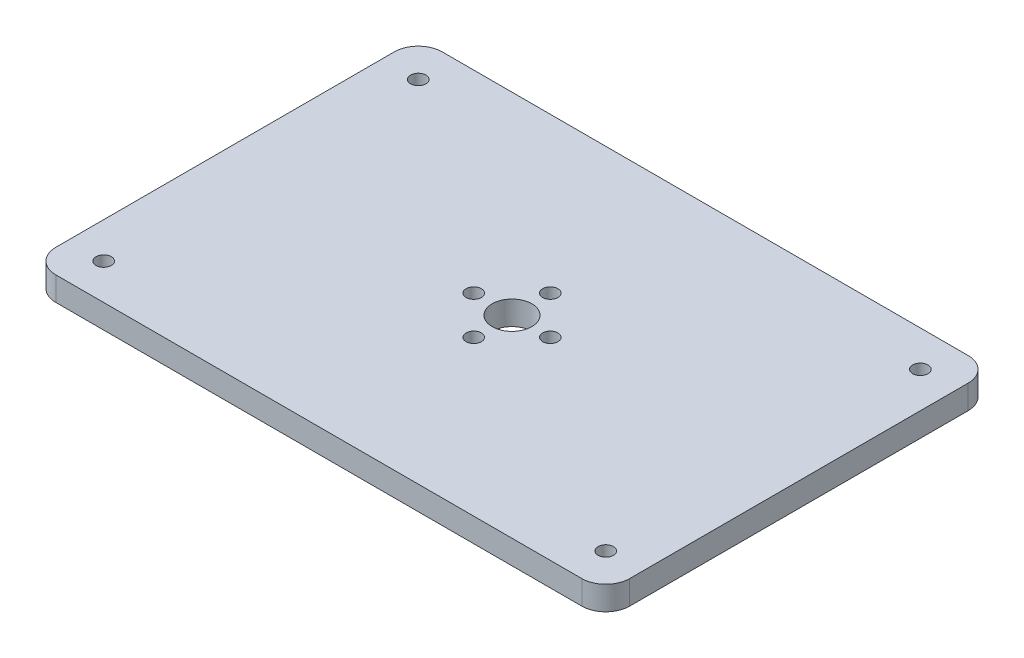
ISO-10303-21;
HEADER;
FILE_DESCRIPTION(('STEP AP214'),'2;1');
FILE_NAME('part.step','',(''),(''),'','','');
FILE_SCHEMA(('AUTOMOTIVE_DESIGN { 1 0 10303 214 1 1 1 1 }'));
ENDSEC;
DATA;
#1=APPLICATION_CONTEXT('core data for automotive mechanical design processes');
#2=APPLICATION_PROTOCOL_DEFINITION('international standard','automotive_design',2000,#1);
#3=PRODUCT_CONTEXT('',#1,'mechanical');
#4=PRODUCT('Part','Part','',(#3));
#5=PRODUCT_RELATED_PRODUCT_CATEGORY('part','',(#4));
#6=PRODUCT_DEFINITION_FORMATION('','',#4);
#7=PRODUCT_DEFINITION_CONTEXT('part definition',#1,'design');
#8=PRODUCT_DEFINITION('design','',#6,#7);
#9=PRODUCT_DEFINITION_SHAPE('','',#8);
#10=(LENGTH_UNIT() NAMED_UNIT(*) SI_UNIT(.MILLI.,.METRE.));
#11=(NAMED_UNIT(*) PLANE_ANGLE_UNIT() SI_UNIT($,.RADIAN.));
#12=(NAMED_UNIT(*) SI_UNIT($,.STERADIAN.) SOLID_ANGLE_UNIT());
#13=UNCERTAINTY_MEASURE_WITH_UNIT(LENGTH_MEASURE(1.E-05),#10,'distance_accuracy_value','');
#14=(GEOMETRIC_REPRESENTATION_CONTEXT(3) GLOBAL_UNCERTAINTY_ASSIGNED_CONTEXT((#13)) GLOBAL_UNIT_ASSIGNED_CONTEXT((#10,
#11,#12)) REPRESENTATION_CONTEXT('',''));
#15=CARTESIAN_POINT('',(0.,0.,0.));
#16=DIRECTION('',(0.,0.,1.));
#17=DIRECTION('',(1.,0.,0.));
#18=AXIS2_PLACEMENT_3D('',#15,#16,#17);
#19=CARTESIAN_POINT('',(0.,5.,0.));
#20=DIRECTION('',(0.,-1.,0.));
#21=DIRECTION('',(0.,0.,-1.));
#22=AXIS2_PLACEMENT_3D('',#19,#20,#21);
#23=PLANE('',#22);
#24=CARTESIAN_POINT('',(7.50000000000001,5.,-73.29));
#25=DIRECTION('',(0.,1.,0.));
#26=DIRECTION('',(0.,0.,1.));
#27=AXIS2_PLACEMENT_3D('',#24,#25,#26);
#28=CIRCLE('',#27,1.6);
#29=CARTESIAN_POINT('',(7.50000000000001,5.,-71.69));
#30=VERTEX_POINT('',#29);
#31=EDGE_CURVE('E215',#30,#30,#28,.T.);
#32=ORIENTED_EDGE('',*,*,#31,.F.);
#33=EDGE_LOOP('',(#32));
#34=FACE_BOUND('',#33,.T.);
#35=CARTESIAN_POINT('',(112.5,5.,-7.49999999999998));
#36=DIRECTION('',(0.,1.,0.));
#37=DIRECTION('',(0.,0.,-1.));
#38=AXIS2_PLACEMENT_3D('',#35,#36,#37);
#39=CIRCLE('',#38,1.60000000000001);
#40=CARTESIAN_POINT('',(112.5,5.,-9.09999999999998));
#41=VERTEX_POINT('',#40);
#42=EDGE_CURVE('E221',#41,#41,#39,.T.);
#43=ORIENTED_EDGE('',*,*,#42,.F.);
#44=EDGE_LOOP('',(#43));
#45=FACE_BOUND('',#44,.T.);
#46=CARTESIAN_POINT('',(112.5,5.,-73.29));
#47=DIRECTION('',(0.,1.,0.));
#48=DIRECTION('',(0.,0.,-1.));
#49=AXIS2_PLACEMENT_3D('',#46,#47,#48);
#50=CIRCLE('',#49,1.60000000000001);
#51=CARTESIAN_POINT('',(112.5,5.,-74.8900000000001));
#52=VERTEX_POINT('',#51);
#53=EDGE_CURVE('E222',#52,#52,#50,.T.);
#54=ORIENTED_EDGE('',*,*,#53,.F.);
#55=EDGE_LOOP('',(#54));
#56=FACE_BOUND('',#55,.T.);
#57=CARTESIAN_POINT('',(7.50000000000001,5.,-7.50000000000001));
#58=DIRECTION('',(0.,1.,0.));
#59=DIRECTION('',(0.,0.,1.));
#60=AXIS2_PLACEMENT_3D('',#57,#58,#59);
#61=CIRCLE('',#60,1.6);
#62=CARTESIAN_POINT('',(7.50000000000001,5.,-5.90000000000001));
#63=VERTEX_POINT('',#62);
#64=EDGE_CURVE('E212',#63,#63,#61,.T.);
#65=ORIENTED_EDGE('',*,*,#64,.F.);
#66=EDGE_LOOP('',(#65));
#67=FACE_BOUND('',#66,.T.);
#68=DIRECTION('',(0.,0.,-1.));
#69=VECTOR('',#68,1.);
#70=CARTESIAN_POINT('',(120.,5.,0.));
#71=LINE('',#70,#69);
#72=CARTESIAN_POINT('',(120.,5.,-5.));
#73=VERTEX_POINT('',#72);
#74=CARTESIAN_POINT('',(120.,5.,-75.79));
#75=VERTEX_POINT('',#74);
#76=EDGE_CURVE('E181',#73,#75,#71,.T.);
#77=ORIENTED_EDGE('',*,*,#76,.T.);
#78=CARTESIAN_POINT('',(115.,5.,-75.79));
#79=DIRECTION('',(0.,-1.,0.));
#80=DIRECTION('',(0.,0.,-1.));
#81=AXIS2_PLACEMENT_3D('',#78,#79,#80);
#82=CIRCLE('',#81,5.);
#83=CARTESIAN_POINT('',(115.,5.,-80.79));
#84=VERTEX_POINT('',#83);
#85=EDGE_CURVE('E158',#75,#84,#82,.F.);
#86=ORIENTED_EDGE('',*,*,#85,.T.);
#87=DIRECTION('',(-1.,0.,0.));
#88=VECTOR('',#87,1.);
#89=CARTESIAN_POINT('',(0.,5.,-80.79));
#90=LINE('',#89,#88);
#91=CARTESIAN_POINT('',(5.,5.,-80.79));
#92=VERTEX_POINT('',#91);
#93=EDGE_CURVE('E129',#84,#92,#90,.T.);
#94=ORIENTED_EDGE('',*,*,#93,.T.);
#95=CARTESIAN_POINT('',(5.,5.,-75.79));
#96=DIRECTION('',(0.,-1.,0.));
#97=DIRECTION('',(0.,0.,-1.));
#98=AXIS2_PLACEMENT_3D('',#95,#96,#97);
#99=CIRCLE('',#98,5.);
#100=CARTESIAN_POINT('',(0.,5.,-75.79));
#101=VERTEX_POINT('',#100);
#102=EDGE_CURVE('E153',#92,#101,#99,.F.);
#103=ORIENTED_EDGE('',*,*,#102,.T.);
#104=DIRECTION('',(0.,0.,1.));
#105=VECTOR('',#104,1.);
#106=CARTESIAN_POINT('',(0.,5.,0.));
#107=LINE('',#106,#105);
#108=CARTESIAN_POINT('',(0.,5.,-5.));
#109=VERTEX_POINT('',#108);
#110=EDGE_CURVE('E136',#101,#109,#107,.T.);
#111=ORIENTED_EDGE('',*,*,#110,.T.);
#112=CARTESIAN_POINT('',(5.,5.,-5.));
#113=DIRECTION('',(0.,-1.,0.));
#114=DIRECTION('',(0.,0.,-1.));
#115=AXIS2_PLACEMENT_3D('',#112,#113,#114);
#116=CIRCLE('',#115,5.);
#117=CARTESIAN_POINT('',(5.,5.,0.));
#118=VERTEX_POINT('',#117);
#119=EDGE_CURVE('E65',#109,#118,#116,.F.);
#120=ORIENTED_EDGE('',*,*,#119,.T.);
#121=DIRECTION('',(1.,0.,0.));
#122=VECTOR('',#121,1.);
#123=CARTESIAN_POINT('',(0.,5.,0.));
#124=LINE('',#123,#122);
#125=CARTESIAN_POINT('',(115.,5.,0.));
#126=VERTEX_POINT('',#125);
#127=EDGE_CURVE('E139',#118,#126,#124,.T.);
#128=ORIENTED_EDGE('',*,*,#127,.T.);
#129=CARTESIAN_POINT('',(115.,5.,-5.));
#130=DIRECTION('',(0.,-1.,0.));
#131=DIRECTION('',(0.,0.,-1.));
#132=AXIS2_PLACEMENT_3D('',#129,#130,#131);
#133=CIRCLE('',#132,5.);
#134=EDGE_CURVE('E156',#126,#73,#133,.F.);
#135=ORIENTED_EDGE('',*,*,#134,.T.);
#136=EDGE_LOOP('',(#77,#86,#94,#103,#111,#120,#128,#135));
#137=FACE_BOUND('',#136,.T.);
#138=CARTESIAN_POINT('',(52.,5.,-40.395));
#139=DIRECTION('',(0.,1.,0.));
#140=DIRECTION('',(0.,0.,1.));
#141=AXIS2_PLACEMENT_3D('',#138,#139,#140);
#142=CIRCLE('',#141,1.6);
#143=CARTESIAN_POINT('',(52.,5.,-38.795));
#144=VERTEX_POINT('',#143);
#145=EDGE_CURVE('E174',#144,#144,#142,.T.);
#146=ORIENTED_EDGE('',*,*,#145,.F.);
#147=EDGE_LOOP('',(#146));
#148=FACE_BOUND('',#147,.T.);
#149=CARTESIAN_POINT('',(60.,5.,-40.395));
#150=DIRECTION('',(0.,1.,0.));
#151=DIRECTION('',(0.,0.,1.));
#152=AXIS2_PLACEMENT_3D('',#149,#150,#151);
#153=CIRCLE('',#152,4.15);
#154=CARTESIAN_POINT('',(60.,5.,-36.245));
#155=VERTEX_POINT('',#154);
#156=EDGE_CURVE('E186',#155,#155,#153,.T.);
#157=ORIENTED_EDGE('',*,*,#156,.F.);
#158=EDGE_LOOP('',(#157));
#159=FACE_BOUND('',#158,.T.);
#160=CARTESIAN_POINT('',(60.,5.,-48.395));
#161=DIRECTION('',(0.,1.,0.));
#162=DIRECTION('',(0.,0.,1.));
#163=AXIS2_PLACEMENT_3D('',#160,#161,#162);
#164=CIRCLE('',#163,1.60000000000001);
#165=CARTESIAN_POINT('',(60.,5.,-46.795));
#166=VERTEX_POINT('',#165);
#167=EDGE_CURVE('E191',#166,#166,#164,.T.);
#168=ORIENTED_EDGE('',*,*,#167,.F.);
#169=EDGE_LOOP('',(#168));
#170=FACE_BOUND('',#169,.T.);
#171=CARTESIAN_POINT('',(68.,5.,-40.395));
#172=DIRECTION('',(0.,1.,0.));
#173=DIRECTION('',(0.,0.,1.));
#174=AXIS2_PLACEMENT_3D('',#171,#172,#173);
#175=CIRCLE('',#174,1.59999999999999);
#176=CARTESIAN_POINT('',(68.,5.,-38.795));
#177=VERTEX_POINT('',#176);
#178=EDGE_CURVE('E197',#177,#177,#175,.T.);
#179=ORIENTED_EDGE('',*,*,#178,.F.);
#180=EDGE_LOOP('',(#179));
#181=FACE_BOUND('',#180,.T.);
#182=CARTESIAN_POINT('',(60.,5.,-32.395));
#183=DIRECTION('',(0.,1.,0.));
#184=DIRECTION('',(0.,0.,1.));
#185=AXIS2_PLACEMENT_3D('',#182,#183,#184);
#186=CIRCLE('',#185,1.6);
#187=CARTESIAN_POINT('',(60.,5.,-30.795));
#188=VERTEX_POINT('',#187);
#189=EDGE_CURVE('E203',#188,#188,#186,.T.);
#190=ORIENTED_EDGE('',*,*,#189,.F.);
#191=EDGE_LOOP('',(#190));
#192=FACE_BOUND('',#191,.T.);
#193=ADVANCED_FACE('F43',(#34,#45,#56,#67,#137,#148,#159,#170,#181,#192),#23,.F.);
#194=CARTESIAN_POINT('',(0.,0.,0.));
#195=DIRECTION('',(0.,-1.,0.));
#196=DIRECTION('',(0.,0.,-1.));
#197=AXIS2_PLACEMENT_3D('',#194,#195,#196);
#198=PLANE('',#197);
#199=CARTESIAN_POINT('',(7.50000000000001,0.,-73.29));
#200=DIRECTION('',(0.,1.,0.));
#201=DIRECTION('',(0.,0.,1.));
#202=AXIS2_PLACEMENT_3D('',#199,#200,#201);
#203=CIRCLE('',#202,1.6);
#204=CARTESIAN_POINT('',(7.50000000000001,0.,-71.69));
#205=VERTEX_POINT('',#204);
#206=EDGE_CURVE('E225',#205,#205,#203,.T.);
#207=ORIENTED_EDGE('',*,*,#206,.T.);
#208=EDGE_LOOP('',(#207));
#209=FACE_BOUND('',#208,.T.);
#210=CARTESIAN_POINT('',(112.5,0.,-7.49999999999998));
#211=DIRECTION('',(0.,1.,0.));
#212=DIRECTION('',(0.,0.,-1.));
#213=AXIS2_PLACEMENT_3D('',#210,#211,#212);
#214=CIRCLE('',#213,1.60000000000001);
#215=CARTESIAN_POINT('',(112.5,0.,-9.09999999999998));
#216=VERTEX_POINT('',#215);
#217=EDGE_CURVE('E218',#216,#216,#214,.T.);
#218=ORIENTED_EDGE('',*,*,#217,.T.);
#219=EDGE_LOOP('',(#218));
#220=FACE_BOUND('',#219,.T.);
#221=CARTESIAN_POINT('',(112.5,0.,-73.29));
#222=DIRECTION('',(0.,1.,0.));
#223=DIRECTION('',(0.,0.,-1.));
#224=AXIS2_PLACEMENT_3D('',#221,#222,#223);
#225=CIRCLE('',#224,1.60000000000001);
#226=CARTESIAN_POINT('',(112.5,0.,-74.8900000000001));
#227=VERTEX_POINT('',#226);
#228=EDGE_CURVE('E230',#227,#227,#225,.T.);
#229=ORIENTED_EDGE('',*,*,#228,.T.);
#230=EDGE_LOOP('',(#229));
#231=FACE_BOUND('',#230,.T.);
#232=CARTESIAN_POINT('',(7.50000000000001,0.,-7.50000000000001));
#233=DIRECTION('',(0.,1.,0.));
#234=DIRECTION('',(0.,0.,1.));
#235=AXIS2_PLACEMENT_3D('',#232,#233,#234);
#236=CIRCLE('',#235,1.6);
#237=CARTESIAN_POINT('',(7.50000000000001,0.,-5.90000000000001));
#238=VERTEX_POINT('',#237);
#239=EDGE_CURVE('E209',#238,#238,#236,.T.);
#240=ORIENTED_EDGE('',*,*,#239,.T.);
#241=EDGE_LOOP('',(#240));
#242=FACE_BOUND('',#241,.T.);
#243=CARTESIAN_POINT('',(68.,0.,-40.395));
#244=DIRECTION('',(0.,1.,0.));
#245=DIRECTION('',(0.,0.,1.));
#246=AXIS2_PLACEMENT_3D('',#243,#244,#245);
#247=CIRCLE('',#246,1.59999999999999);
#248=CARTESIAN_POINT('',(68.,0.,-38.795));
#249=VERTEX_POINT('',#248);
#250=EDGE_CURVE('E200',#249,#249,#247,.T.);
#251=ORIENTED_EDGE('',*,*,#250,.T.);
#252=EDGE_LOOP('',(#251));
#253=FACE_BOUND('',#252,.T.);
#254=CARTESIAN_POINT('',(60.,0.,-40.395));
#255=DIRECTION('',(0.,1.,0.));
#256=DIRECTION('',(0.,0.,1.));
#257=AXIS2_PLACEMENT_3D('',#254,#255,#256);
#258=CIRCLE('',#257,4.15);
#259=CARTESIAN_POINT('',(60.,0.,-36.245));
#260=VERTEX_POINT('',#259);
#261=EDGE_CURVE('E188',#260,#260,#258,.T.);
#262=ORIENTED_EDGE('',*,*,#261,.T.);
#263=EDGE_LOOP('',(#262));
#264=FACE_BOUND('',#263,.T.);
#265=DIRECTION('',(-1.,0.,0.));
#266=VECTOR('',#265,1.);
#267=CARTESIAN_POINT('',(0.,0.,-80.79));
#268=LINE('',#267,#266);
#269=CARTESIAN_POINT('',(115.,0.,-80.79));
#270=VERTEX_POINT('',#269);
#271=CARTESIAN_POINT('',(5.,0.,-80.79));
#272=VERTEX_POINT('',#271);
#273=EDGE_CURVE('E126',#270,#272,#268,.T.);
#274=ORIENTED_EDGE('',*,*,#273,.F.);
#275=CARTESIAN_POINT('',(115.,0.,-75.79));
#276=DIRECTION('',(0.,-1.,0.));
#277=DIRECTION('',(0.,0.,-1.));
#278=AXIS2_PLACEMENT_3D('',#275,#276,#277);
#279=CIRCLE('',#278,5.);
#280=CARTESIAN_POINT('',(120.,0.,-75.79));
#281=VERTEX_POINT('',#280);
#282=EDGE_CURVE('E109',#270,#281,#279,.T.);
#283=ORIENTED_EDGE('',*,*,#282,.T.);
#284=DIRECTION('',(0.,0.,-1.));
#285=VECTOR('',#284,1.);
#286=CARTESIAN_POINT('',(120.,0.,0.));
#287=LINE('',#286,#285);
#288=CARTESIAN_POINT('',(120.,0.,-5.));
#289=VERTEX_POINT('',#288);
#290=EDGE_CURVE('E137',#289,#281,#287,.T.);
#291=ORIENTED_EDGE('',*,*,#290,.F.);
#292=CARTESIAN_POINT('',(115.,0.,-5.));
#293=DIRECTION('',(0.,-1.,0.));
#294=DIRECTION('',(0.,0.,-1.));
#295=AXIS2_PLACEMENT_3D('',#292,#293,#294);
#296=CIRCLE('',#295,5.);
#297=CARTESIAN_POINT('',(115.,0.,0.));
#298=VERTEX_POINT('',#297);
#299=EDGE_CURVE('E120',#289,#298,#296,.T.);
#300=ORIENTED_EDGE('',*,*,#299,.T.);
#301=DIRECTION('',(1.,0.,0.));
#302=VECTOR('',#301,1.);
#303=CARTESIAN_POINT('',(0.,0.,0.));
#304=LINE('',#303,#302);
#305=CARTESIAN_POINT('',(5.,0.,0.));
#306=VERTEX_POINT('',#305);
#307=EDGE_CURVE('E141',#306,#298,#304,.T.);
#308=ORIENTED_EDGE('',*,*,#307,.F.);
#309=CARTESIAN_POINT('',(5.,0.,-5.));
#310=DIRECTION('',(0.,-1.,0.));
#311=DIRECTION('',(0.,0.,-1.));
#312=AXIS2_PLACEMENT_3D('',#309,#310,#311);
#313=CIRCLE('',#312,5.);
#314=CARTESIAN_POINT('',(0.,0.,-5.));
#315=VERTEX_POINT('',#314);
#316=EDGE_CURVE('E147',#306,#315,#313,.T.);
#317=ORIENTED_EDGE('',*,*,#316,.T.);
#318=DIRECTION('',(0.,0.,1.));
#319=VECTOR('',#318,1.);
#320=CARTESIAN_POINT('',(0.,0.,0.));
#321=LINE('',#320,#319);
#322=CARTESIAN_POINT('',(0.,0.,-75.79));
#323=VERTEX_POINT('',#322);
#324=EDGE_CURVE('E169',#323,#315,#321,.T.);
#325=ORIENTED_EDGE('',*,*,#324,.F.);
#326=CARTESIAN_POINT('',(5.,0.,-75.79));
#327=DIRECTION('',(0.,-1.,0.));
#328=DIRECTION('',(0.,0.,-1.));
#329=AXIS2_PLACEMENT_3D('',#326,#327,#328);
#330=CIRCLE('',#329,5.);
#331=EDGE_CURVE('E130',#323,#272,#330,.T.);
#332=ORIENTED_EDGE('',*,*,#331,.T.);
#333=EDGE_LOOP('',(#274,#283,#291,#300,#308,#317,#325,#332));
#334=FACE_BOUND('',#333,.T.);
#335=CARTESIAN_POINT('',(52.,0.,-40.395));
#336=DIRECTION('',(0.,1.,0.));
#337=DIRECTION('',(0.,0.,1.));
#338=AXIS2_PLACEMENT_3D('',#335,#336,#337);
#339=CIRCLE('',#338,1.6);
#340=CARTESIAN_POINT('',(52.,0.,-38.795));
#341=VERTEX_POINT('',#340);
#342=EDGE_CURVE('E177',#341,#341,#339,.T.);
#343=ORIENTED_EDGE('',*,*,#342,.T.);
#344=EDGE_LOOP('',(#343));
#345=FACE_BOUND('',#344,.T.);
#346=CARTESIAN_POINT('',(60.,0.,-48.395));
#347=DIRECTION('',(0.,1.,0.));
#348=DIRECTION('',(0.,0.,1.));
#349=AXIS2_PLACEMENT_3D('',#346,#347,#348);
#350=CIRCLE('',#349,1.60000000000001);
#351=CARTESIAN_POINT('',(60.,0.,-46.795));
#352=VERTEX_POINT('',#351);
#353=EDGE_CURVE('E194',#352,#352,#350,.T.);
#354=ORIENTED_EDGE('',*,*,#353,.T.);
#355=EDGE_LOOP('',(#354));
#356=FACE_BOUND('',#355,.T.);
#357=CARTESIAN_POINT('',(60.,0.,-32.395));
#358=DIRECTION('',(0.,1.,0.));
#359=DIRECTION('',(0.,0.,1.));
#360=AXIS2_PLACEMENT_3D('',#357,#358,#359);
#361=CIRCLE('',#360,1.6);
#362=CARTESIAN_POINT('',(60.,0.,-30.795));
#363=VERTEX_POINT('',#362);
#364=EDGE_CURVE('E206',#363,#363,#361,.T.);
#365=ORIENTED_EDGE('',*,*,#364,.T.);
#366=EDGE_LOOP('',(#365));
#367=FACE_BOUND('',#366,.T.);
#368=ADVANCED_FACE('F133',(#209,#220,#231,#242,#253,#264,#334,#345,#356,#367),#198,.T.);
#369=CARTESIAN_POINT('',(0.,5.,0.));
#370=DIRECTION('',(1.,0.,0.));
#371=DIRECTION('',(0.,0.,-1.));
#372=AXIS2_PLACEMENT_3D('',#369,#370,#371);
#373=PLANE('',#372);
#374=ORIENTED_EDGE('',*,*,#324,.T.);
#375=DIRECTION('',(0.,-1.,0.));
#376=VECTOR('',#375,1.);
#377=CARTESIAN_POINT('',(0.,5.,-5.));
#378=LINE('',#377,#376);
#379=EDGE_CURVE('E11',#315,#109,#378,.F.);
#380=ORIENTED_EDGE('',*,*,#379,.T.);
#381=ORIENTED_EDGE('',*,*,#110,.F.);
#382=DIRECTION('',(0.,-1.,0.));
#383=VECTOR('',#382,1.);
#384=CARTESIAN_POINT('',(0.,5.,-75.79));
#385=LINE('',#384,#383);
#386=EDGE_CURVE('E51',#101,#323,#385,.T.);
#387=ORIENTED_EDGE('',*,*,#386,.T.);
#388=EDGE_LOOP('',(#374,#380,#381,#387));
#389=FACE_BOUND('',#388,.T.);
#390=ADVANCED_FACE('F168',(#389),#373,.F.);
#391=CARTESIAN_POINT('',(0.,5.,0.));
#392=DIRECTION('',(0.,0.,-1.));
#393=DIRECTION('',(-1.,0.,0.));
#394=AXIS2_PLACEMENT_3D('',#391,#392,#393);
#395=PLANE('',#394);
#396=ORIENTED_EDGE('',*,*,#307,.T.);
#397=DIRECTION('',(0.,-1.,0.));
#398=VECTOR('',#397,1.);
#399=CARTESIAN_POINT('',(115.,5.,0.));
#400=LINE('',#399,#398);
#401=EDGE_CURVE('E58',#298,#126,#400,.F.);
#402=ORIENTED_EDGE('',*,*,#401,.T.);
#403=ORIENTED_EDGE('',*,*,#127,.F.);
#404=DIRECTION('',(0.,-1.,0.));
#405=VECTOR('',#404,1.);
#406=CARTESIAN_POINT('',(5.,5.,0.));
#407=LINE('',#406,#405);
#408=EDGE_CURVE('E160',#118,#306,#407,.T.);
#409=ORIENTED_EDGE('',*,*,#408,.T.);
#410=EDGE_LOOP('',(#396,#402,#403,#409));
#411=FACE_BOUND('',#410,.T.);
#412=ADVANCED_FACE('F269',(#411),#395,.F.);
#413=CARTESIAN_POINT('',(120.,5.,0.));
#414=DIRECTION('',(-1.,0.,0.));
#415=DIRECTION('',(0.,0.,1.));
#416=AXIS2_PLACEMENT_3D('',#413,#414,#415);
#417=PLANE('',#416);
#418=ORIENTED_EDGE('',*,*,#290,.T.);
#419=DIRECTION('',(0.,-1.,0.));
#420=VECTOR('',#419,1.);
#421=CARTESIAN_POINT('',(120.,5.,-75.79));
#422=LINE('',#421,#420);
#423=EDGE_CURVE('E114',#281,#75,#422,.F.);
#424=ORIENTED_EDGE('',*,*,#423,.T.);
#425=ORIENTED_EDGE('',*,*,#76,.F.);
#426=DIRECTION('',(0.,-1.,0.));
#427=VECTOR('',#426,1.);
#428=CARTESIAN_POINT('',(120.,5.,-5.));
#429=LINE('',#428,#427);
#430=EDGE_CURVE('E119',#73,#289,#429,.T.);
#431=ORIENTED_EDGE('',*,*,#430,.T.);
#432=EDGE_LOOP('',(#418,#424,#425,#431));
#433=FACE_BOUND('',#432,.T.);
#434=ADVANCED_FACE('F277',(#433),#417,.F.);
#435=CARTESIAN_POINT('',(0.,5.,-80.79));
#436=DIRECTION('',(0.,0.,1.));
#437=DIRECTION('',(1.,0.,0.));
#438=AXIS2_PLACEMENT_3D('',#435,#436,#437);
#439=PLANE('',#438);
#440=ORIENTED_EDGE('',*,*,#93,.F.);
#441=DIRECTION('',(0.,-1.,0.));
#442=VECTOR('',#441,1.);
#443=CARTESIAN_POINT('',(115.,5.,-80.79));
#444=LINE('',#443,#442);
#445=EDGE_CURVE('E113',#84,#270,#444,.T.);
#446=ORIENTED_EDGE('',*,*,#445,.T.);
#447=ORIENTED_EDGE('',*,*,#273,.T.);
#448=DIRECTION('',(0.,-1.,0.));
#449=VECTOR('',#448,1.);
#450=CARTESIAN_POINT('',(5.,5.,-80.79));
#451=LINE('',#450,#449);
#452=EDGE_CURVE('E131',#272,#92,#451,.F.);
#453=ORIENTED_EDGE('',*,*,#452,.T.);
#454=EDGE_LOOP('',(#440,#446,#447,#453));
#455=FACE_BOUND('',#454,.T.);
#456=ADVANCED_FACE('F125',(#455),#439,.F.);
#457=CARTESIAN_POINT('',(52.,5.,-40.395));
#458=DIRECTION('',(0.,-1.,0.));
#459=DIRECTION('',(0.,0.,-1.));
#460=AXIS2_PLACEMENT_3D('',#457,#458,#459);
#461=CYLINDRICAL_SURFACE('',#460,1.6);
#462=ORIENTED_EDGE('',*,*,#145,.T.);
#463=EDGE_LOOP('',(#462));
#464=FACE_BOUND('',#463,.T.);
#465=ORIENTED_EDGE('',*,*,#342,.F.);
#466=EDGE_LOOP('',(#465));
#467=FACE_BOUND('',#466,.T.);
#468=ADVANCED_FACE('F276',(#464,#467),#461,.F.);
#469=CARTESIAN_POINT('',(60.,5.,-40.395));
#470=DIRECTION('',(0.,-1.,0.));
#471=DIRECTION('',(0.,0.,-1.));
#472=AXIS2_PLACEMENT_3D('',#469,#470,#471);
#473=CYLINDRICAL_SURFACE('',#472,4.15);
#474=ORIENTED_EDGE('',*,*,#156,.T.);
#475=EDGE_LOOP('',(#474));
#476=FACE_BOUND('',#475,.T.);
#477=ORIENTED_EDGE('',*,*,#261,.F.);
#478=EDGE_LOOP('',(#477));
#479=FACE_BOUND('',#478,.T.);
#480=ADVANCED_FACE('F379',(#476,#479),#473,.F.);
#481=CARTESIAN_POINT('',(60.,5.,-48.395));
#482=DIRECTION('',(0.,-1.,0.));
#483=DIRECTION('',(0.,0.,-1.));
#484=AXIS2_PLACEMENT_3D('',#481,#482,#483);
#485=CYLINDRICAL_SURFACE('',#484,1.60000000000001);
#486=ORIENTED_EDGE('',*,*,#167,.T.);
#487=EDGE_LOOP('',(#486));
#488=FACE_BOUND('',#487,.T.);
#489=ORIENTED_EDGE('',*,*,#353,.F.);
#490=EDGE_LOOP('',(#489));
#491=FACE_BOUND('',#490,.T.);
#492=ADVANCED_FACE('F369',(#488,#491),#485,.F.);
#493=CARTESIAN_POINT('',(68.,5.,-40.395));
#494=DIRECTION('',(0.,-1.,0.));
#495=DIRECTION('',(0.,0.,-1.));
#496=AXIS2_PLACEMENT_3D('',#493,#494,#495);
#497=CYLINDRICAL_SURFACE('',#496,1.59999999999999);
#498=ORIENTED_EDGE('',*,*,#178,.T.);
#499=EDGE_LOOP('',(#498));
#500=FACE_BOUND('',#499,.T.);
#501=ORIENTED_EDGE('',*,*,#250,.F.);
#502=EDGE_LOOP('',(#501));
#503=FACE_BOUND('',#502,.T.);
#504=ADVANCED_FACE('F259',(#500,#503),#497,.F.);
#505=CARTESIAN_POINT('',(60.,5.,-32.395));
#506=DIRECTION('',(0.,-1.,0.));
#507=DIRECTION('',(0.,0.,-1.));
#508=AXIS2_PLACEMENT_3D('',#505,#506,#507);
#509=CYLINDRICAL_SURFACE('',#508,1.6);
#510=ORIENTED_EDGE('',*,*,#189,.T.);
#511=EDGE_LOOP('',(#510));
#512=FACE_BOUND('',#511,.T.);
#513=ORIENTED_EDGE('',*,*,#364,.F.);
#514=EDGE_LOOP('',(#513));
#515=FACE_BOUND('',#514,.T.);
#516=ADVANCED_FACE('F255',(#512,#515),#509,.F.);
#517=CARTESIAN_POINT('',(7.50000000000001,0.,-7.50000000000001));
#518=DIRECTION('',(0.,1.,0.));
#519=DIRECTION('',(0.,0.,1.));
#520=AXIS2_PLACEMENT_3D('',#517,#518,#519);
#521=CYLINDRICAL_SURFACE('',#520,1.6);
#522=ORIENTED_EDGE('',*,*,#239,.F.);
#523=EDGE_LOOP('',(#522));
#524=FACE_BOUND('',#523,.T.);
#525=ORIENTED_EDGE('',*,*,#64,.T.);
#526=EDGE_LOOP('',(#525));
#527=FACE_BOUND('',#526,.T.);
#528=ADVANCED_FACE('F258',(#524,#527),#521,.F.);
#529=CARTESIAN_POINT('',(112.5,0.,-73.29));
#530=DIRECTION('',(0.,1.,0.));
#531=DIRECTION('',(0.,0.,1.));
#532=AXIS2_PLACEMENT_3D('',#529,#530,#531);
#533=CYLINDRICAL_SURFACE('',#532,1.60000000000001);
#534=ORIENTED_EDGE('',*,*,#228,.F.);
#535=EDGE_LOOP('',(#534));
#536=FACE_BOUND('',#535,.T.);
#537=ORIENTED_EDGE('',*,*,#53,.T.);
#538=EDGE_LOOP('',(#537));
#539=FACE_BOUND('',#538,.T.);
#540=ADVANCED_FACE('F236',(#536,#539),#533,.F.);
#541=CARTESIAN_POINT('',(112.5,0.,-7.49999999999998));
#542=DIRECTION('',(0.,1.,0.));
#543=DIRECTION('',(0.,0.,1.));
#544=AXIS2_PLACEMENT_3D('',#541,#542,#543);
#545=CYLINDRICAL_SURFACE('',#544,1.60000000000001);
#546=ORIENTED_EDGE('',*,*,#217,.F.);
#547=EDGE_LOOP('',(#546));
#548=FACE_BOUND('',#547,.T.);
#549=ORIENTED_EDGE('',*,*,#42,.T.);
#550=EDGE_LOOP('',(#549));
#551=FACE_BOUND('',#550,.T.);
#552=ADVANCED_FACE('F326',(#548,#551),#545,.F.);
#553=CARTESIAN_POINT('',(7.50000000000001,0.,-73.29));
#554=DIRECTION('',(0.,1.,0.));
#555=DIRECTION('',(0.,0.,1.));
#556=AXIS2_PLACEMENT_3D('',#553,#554,#555);
#557=CYLINDRICAL_SURFACE('',#556,1.6);
#558=ORIENTED_EDGE('',*,*,#206,.F.);
#559=EDGE_LOOP('',(#558));
#560=FACE_BOUND('',#559,.T.);
#561=ORIENTED_EDGE('',*,*,#31,.T.);
#562=EDGE_LOOP('',(#561));
#563=FACE_BOUND('',#562,.T.);
#564=ADVANCED_FACE('F286',(#560,#563),#557,.F.);
#565=CARTESIAN_POINT('',(115.,5.,-75.79));
#566=DIRECTION('',(0.,-1.,0.));
#567=DIRECTION('',(0.,0.,-1.));
#568=AXIS2_PLACEMENT_3D('',#565,#566,#567);
#569=CYLINDRICAL_SURFACE('',#568,5.);
#570=ORIENTED_EDGE('',*,*,#85,.F.);
#571=ORIENTED_EDGE('',*,*,#423,.F.);
#572=ORIENTED_EDGE('',*,*,#282,.F.);
#573=ORIENTED_EDGE('',*,*,#445,.F.);
#574=EDGE_LOOP('',(#570,#571,#572,#573));
#575=FACE_BOUND('',#574,.T.);
#576=ADVANCED_FACE('F112',(#575),#569,.T.);
#577=CARTESIAN_POINT('',(115.,5.,-5.));
#578=DIRECTION('',(0.,-1.,0.));
#579=DIRECTION('',(0.,0.,-1.));
#580=AXIS2_PLACEMENT_3D('',#577,#578,#579);
#581=CYLINDRICAL_SURFACE('',#580,5.);
#582=ORIENTED_EDGE('',*,*,#134,.F.);
#583=ORIENTED_EDGE('',*,*,#401,.F.);
#584=ORIENTED_EDGE('',*,*,#299,.F.);
#585=ORIENTED_EDGE('',*,*,#430,.F.);
#586=EDGE_LOOP('',(#582,#583,#584,#585));
#587=FACE_BOUND('',#586,.T.);
#588=ADVANCED_FACE('F285',(#587),#581,.T.);
#589=CARTESIAN_POINT('',(5.,5.,-5.));
#590=DIRECTION('',(0.,-1.,0.));
#591=DIRECTION('',(0.,0.,-1.));
#592=AXIS2_PLACEMENT_3D('',#589,#590,#591);
#593=CYLINDRICAL_SURFACE('',#592,5.);
#594=ORIENTED_EDGE('',*,*,#119,.F.);
#595=ORIENTED_EDGE('',*,*,#379,.F.);
#596=ORIENTED_EDGE('',*,*,#316,.F.);
#597=ORIENTED_EDGE('',*,*,#408,.F.);
#598=EDGE_LOOP('',(#594,#595,#596,#597));
#599=FACE_BOUND('',#598,.T.);
#600=ADVANCED_FACE('F288',(#599),#593,.T.);
#601=CARTESIAN_POINT('',(5.,5.,-75.79));
#602=DIRECTION('',(0.,-1.,0.));
#603=DIRECTION('',(0.,0.,-1.));
#604=AXIS2_PLACEMENT_3D('',#601,#602,#603);
#605=CYLINDRICAL_SURFACE('',#604,5.);
#606=ORIENTED_EDGE('',*,*,#102,.F.);
#607=ORIENTED_EDGE('',*,*,#452,.F.);
#608=ORIENTED_EDGE('',*,*,#331,.F.);
#609=ORIENTED_EDGE('',*,*,#386,.F.);
#610=EDGE_LOOP('',(#606,#607,#608,#609));
#611=FACE_BOUND('',#610,.T.);
#612=ADVANCED_FACE('F45',(#611),#605,.T.);
#613=CLOSED_SHELL('',(#193,#368,#390,#412,#434,#456,#468,#480,#492,#504,#516,#528,#540,#552,
#564,#576,#588,#600,#612));
#614=MANIFOLD_SOLID_BREP('B2',#613);
#615=ADVANCED_BREP_SHAPE_REPRESENTATION('',(#18,#614),#14);
#616=SHAPE_DEFINITION_REPRESENTATION(#9,#615);
ENDSEC;
END-ISO-10303-21;
